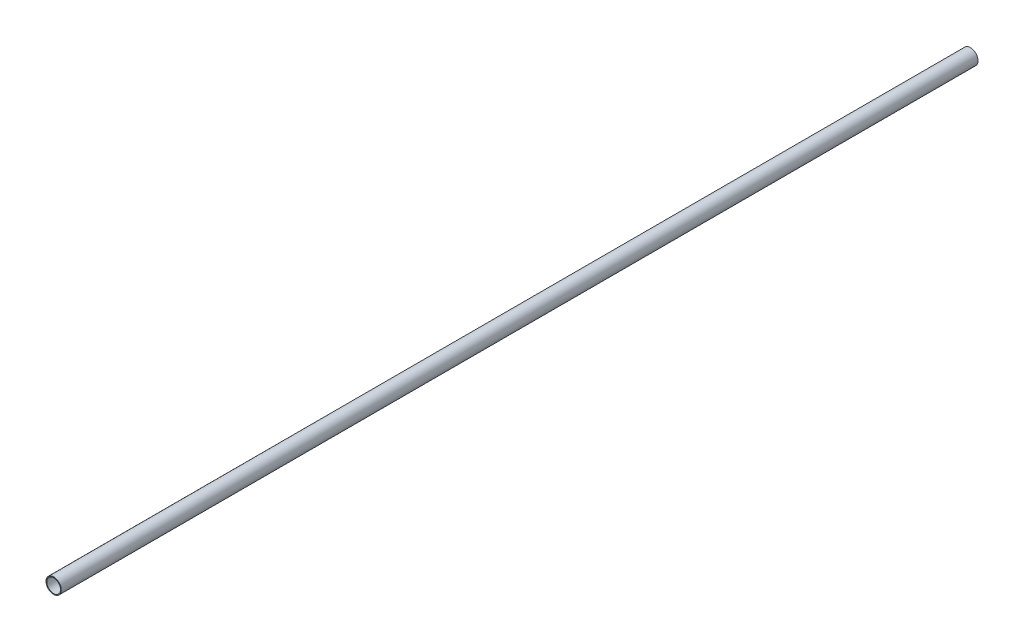
ISO-10303-21;
HEADER;
FILE_DESCRIPTION(('STEP AP214'),'2;1');
FILE_NAME('part.step','',(''),(''),'','','');
FILE_SCHEMA(('AUTOMOTIVE_DESIGN { 1 0 10303 214 1 1 1 1 }'));
ENDSEC;
DATA;
#1=APPLICATION_CONTEXT('core data for automotive mechanical design processes');
#2=APPLICATION_PROTOCOL_DEFINITION('international standard','automotive_design',2000,#1);
#3=PRODUCT_CONTEXT('',#1,'mechanical');
#4=PRODUCT('Part','Part','',(#3));
#5=PRODUCT_RELATED_PRODUCT_CATEGORY('part','',(#4));
#6=PRODUCT_DEFINITION_FORMATION('','',#4);
#7=PRODUCT_DEFINITION_CONTEXT('part definition',#1,'design');
#8=PRODUCT_DEFINITION('design','',#6,#7);
#9=PRODUCT_DEFINITION_SHAPE('','',#8);
#10=(LENGTH_UNIT() NAMED_UNIT(*) SI_UNIT(.MILLI.,.METRE.));
#11=(NAMED_UNIT(*) PLANE_ANGLE_UNIT() SI_UNIT($,.RADIAN.));
#12=(NAMED_UNIT(*) SI_UNIT($,.STERADIAN.) SOLID_ANGLE_UNIT());
#13=UNCERTAINTY_MEASURE_WITH_UNIT(LENGTH_MEASURE(1.E-05),#10,'distance_accuracy_value','');
#14=(GEOMETRIC_REPRESENTATION_CONTEXT(3) GLOBAL_UNCERTAINTY_ASSIGNED_CONTEXT((#13)) GLOBAL_UNIT_ASSIGNED_CONTEXT((#10,
#11,#12)) REPRESENTATION_CONTEXT('',''));
#15=CARTESIAN_POINT('',(0.,0.,0.));
#16=DIRECTION('',(0.,0.,1.));
#17=DIRECTION('',(1.,0.,0.));
#18=AXIS2_PLACEMENT_3D('',#15,#16,#17);
#19=CARTESIAN_POINT('',(0.,0.,600.));
#20=DIRECTION('',(0.,0.,1.));
#21=DIRECTION('',(1.,0.,0.));
#22=AXIS2_PLACEMENT_3D('',#19,#20,#21);
#23=PLANE('',#22);
#24=CARTESIAN_POINT('',(0.,0.,600.));
#25=DIRECTION('',(0.,0.,1.));
#26=DIRECTION('',(1.,0.,0.));
#27=AXIS2_PLACEMENT_3D('',#24,#25,#26);
#28=CIRCLE('',#27,10.);
#29=CARTESIAN_POINT('',(10.,0.,600.));
#30=VERTEX_POINT('',#29);
#31=EDGE_CURVE('E10',#30,#30,#28,.T.);
#32=ORIENTED_EDGE('',*,*,#31,.T.);
#33=EDGE_LOOP('',(#32));
#34=FACE_BOUND('',#33,.T.);
#35=CARTESIAN_POINT('',(0.,0.,600.));
#36=DIRECTION('',(0.,0.,1.));
#37=DIRECTION('',(1.,0.,0.));
#38=AXIS2_PLACEMENT_3D('',#35,#36,#37);
#39=CIRCLE('',#38,9.);
#40=CARTESIAN_POINT('',(9.,0.,600.));
#41=VERTEX_POINT('',#40);
#42=EDGE_CURVE('E44',#41,#41,#39,.T.);
#43=ORIENTED_EDGE('',*,*,#42,.F.);
#44=EDGE_LOOP('',(#43));
#45=FACE_BOUND('',#44,.T.);
#46=ADVANCED_FACE('F33',(#34,#45),#23,.T.);
#47=CARTESIAN_POINT('',(0.,0.,-600.));
#48=DIRECTION('',(0.,0.,1.));
#49=DIRECTION('',(1.,0.,0.));
#50=AXIS2_PLACEMENT_3D('',#47,#48,#49);
#51=PLANE('',#50);
#52=CARTESIAN_POINT('',(0.,0.,-600.));
#53=DIRECTION('',(0.,0.,1.));
#54=DIRECTION('',(1.,0.,0.));
#55=AXIS2_PLACEMENT_3D('',#52,#53,#54);
#56=CIRCLE('',#55,10.);
#57=CARTESIAN_POINT('',(10.,0.,-600.));
#58=VERTEX_POINT('',#57);
#59=EDGE_CURVE('E37',#58,#58,#56,.T.);
#60=ORIENTED_EDGE('',*,*,#59,.F.);
#61=EDGE_LOOP('',(#60));
#62=FACE_BOUND('',#61,.T.);
#63=CARTESIAN_POINT('',(0.,0.,-600.));
#64=DIRECTION('',(0.,0.,1.));
#65=DIRECTION('',(1.,0.,0.));
#66=AXIS2_PLACEMENT_3D('',#63,#64,#65);
#67=CIRCLE('',#66,9.);
#68=CARTESIAN_POINT('',(9.,0.,-600.));
#69=VERTEX_POINT('',#68);
#70=EDGE_CURVE('E46',#69,#69,#67,.T.);
#71=ORIENTED_EDGE('',*,*,#70,.T.);
#72=EDGE_LOOP('',(#71));
#73=FACE_BOUND('',#72,.T.);
#74=ADVANCED_FACE('F56',(#62,#73),#51,.F.);
#75=CARTESIAN_POINT('',(0.,0.,600.));
#76=DIRECTION('',(0.,0.,-1.));
#77=DIRECTION('',(-1.,0.,0.));
#78=AXIS2_PLACEMENT_3D('',#75,#76,#77);
#79=CYLINDRICAL_SURFACE('',#78,10.);
#80=ORIENTED_EDGE('',*,*,#31,.F.);
#81=EDGE_LOOP('',(#80));
#82=FACE_BOUND('',#81,.T.);
#83=ORIENTED_EDGE('',*,*,#59,.T.);
#84=EDGE_LOOP('',(#83));
#85=FACE_BOUND('',#84,.T.);
#86=ADVANCED_FACE('F35',(#82,#85),#79,.T.);
#87=CARTESIAN_POINT('',(0.,0.,600.));
#88=DIRECTION('',(0.,0.,-1.));
#89=DIRECTION('',(-1.,0.,0.));
#90=AXIS2_PLACEMENT_3D('',#87,#88,#89);
#91=CYLINDRICAL_SURFACE('',#90,9.);
#92=ORIENTED_EDGE('',*,*,#42,.T.);
#93=EDGE_LOOP('',(#92));
#94=FACE_BOUND('',#93,.T.);
#95=ORIENTED_EDGE('',*,*,#70,.F.);
#96=EDGE_LOOP('',(#95));
#97=FACE_BOUND('',#96,.T.);
#98=ADVANCED_FACE('F52',(#94,#97),#91,.F.);
#99=CLOSED_SHELL('',(#46,#74,#86,#98));
#100=MANIFOLD_SOLID_BREP('B2',#99);
#101=ADVANCED_BREP_SHAPE_REPRESENTATION('',(#18,#100),#14);
#102=SHAPE_DEFINITION_REPRESENTATION(#9,#101);
ENDSEC;
END-ISO-10303-21;
